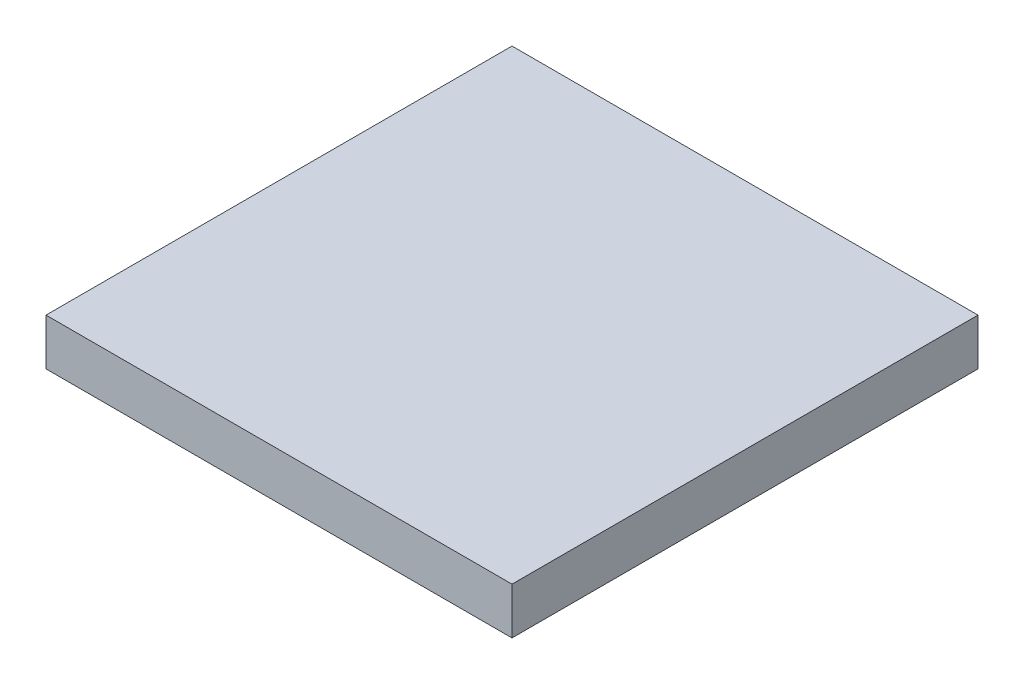
ISO-10303-21;
HEADER;
FILE_DESCRIPTION(('STEP AP214'),'2;1');
FILE_NAME('part.step','',(''),(''),'','','');
FILE_SCHEMA(('AUTOMOTIVE_DESIGN { 1 0 10303 214 1 1 1 1 }'));
ENDSEC;
DATA;
#1=APPLICATION_CONTEXT('core data for automotive mechanical design processes');
#2=APPLICATION_PROTOCOL_DEFINITION('international standard','automotive_design',2000,#1);
#3=PRODUCT_CONTEXT('',#1,'mechanical');
#4=PRODUCT('Part','Part','',(#3));
#5=PRODUCT_RELATED_PRODUCT_CATEGORY('part','',(#4));
#6=PRODUCT_DEFINITION_FORMATION('','',#4);
#7=PRODUCT_DEFINITION_CONTEXT('part definition',#1,'design');
#8=PRODUCT_DEFINITION('design','',#6,#7);
#9=PRODUCT_DEFINITION_SHAPE('','',#8);
#10=(LENGTH_UNIT() NAMED_UNIT(*) SI_UNIT(.MILLI.,.METRE.));
#11=(NAMED_UNIT(*) PLANE_ANGLE_UNIT() SI_UNIT($,.RADIAN.));
#12=(NAMED_UNIT(*) SI_UNIT($,.STERADIAN.) SOLID_ANGLE_UNIT());
#13=UNCERTAINTY_MEASURE_WITH_UNIT(LENGTH_MEASURE(1.E-05),#10,'distance_accuracy_value','');
#14=(GEOMETRIC_REPRESENTATION_CONTEXT(3) GLOBAL_UNCERTAINTY_ASSIGNED_CONTEXT((#13)) GLOBAL_UNIT_ASSIGNED_CONTEXT((#10,
#11,#12)) REPRESENTATION_CONTEXT('',''));
#15=CARTESIAN_POINT('',(0.,0.,0.));
#16=DIRECTION('',(0.,0.,1.));
#17=DIRECTION('',(1.,0.,0.));
#18=AXIS2_PLACEMENT_3D('',#15,#16,#17);
#19=CARTESIAN_POINT('',(-2.5,0.5,-2.5));
#20=DIRECTION('',(1.,0.,0.));
#21=DIRECTION('',(0.,0.,-1.));
#22=AXIS2_PLACEMENT_3D('',#19,#20,#21);
#23=PLANE('',#22);
#24=DIRECTION('',(0.,0.,1.));
#25=VECTOR('',#24,1.);
#26=CARTESIAN_POINT('',(-2.5,0.,-2.5));
#27=LINE('',#26,#25);
#28=CARTESIAN_POINT('',(-2.5,0.,-2.5));
#29=VERTEX_POINT('',#28);
#30=CARTESIAN_POINT('',(-2.5,0.,2.5));
#31=VERTEX_POINT('',#30);
#32=EDGE_CURVE('E97',#29,#31,#27,.T.);
#33=ORIENTED_EDGE('',*,*,#32,.T.);
#34=DIRECTION('',(0.,-1.,0.));
#35=VECTOR('',#34,1.);
#36=CARTESIAN_POINT('',(-2.5,0.5,2.5));
#37=LINE('',#36,#35);
#38=CARTESIAN_POINT('',(-2.5,0.5,2.5));
#39=VERTEX_POINT('',#38);
#40=EDGE_CURVE('E11',#39,#31,#37,.T.);
#41=ORIENTED_EDGE('',*,*,#40,.F.);
#42=DIRECTION('',(0.,0.,1.));
#43=VECTOR('',#42,1.);
#44=CARTESIAN_POINT('',(-2.5,0.5,-2.5));
#45=LINE('',#44,#43);
#46=CARTESIAN_POINT('',(-2.5,0.5,-2.5));
#47=VERTEX_POINT('',#46);
#48=EDGE_CURVE('E85',#47,#39,#45,.T.);
#49=ORIENTED_EDGE('',*,*,#48,.F.);
#50=DIRECTION('',(0.,-1.,0.));
#51=VECTOR('',#50,1.);
#52=CARTESIAN_POINT('',(-2.5,0.5,-2.5));
#53=LINE('',#52,#51);
#54=EDGE_CURVE('E93',#47,#29,#53,.T.);
#55=ORIENTED_EDGE('',*,*,#54,.T.);
#56=EDGE_LOOP('',(#33,#41,#49,#55));
#57=FACE_BOUND('',#56,.T.);
#58=ADVANCED_FACE('F34',(#57),#23,.F.);
#59=CARTESIAN_POINT('',(-2.5,0.5,2.5));
#60=DIRECTION('',(0.,0.,-1.));
#61=DIRECTION('',(-1.,0.,0.));
#62=AXIS2_PLACEMENT_3D('',#59,#60,#61);
#63=PLANE('',#62);
#64=DIRECTION('',(1.,0.,0.));
#65=VECTOR('',#64,1.);
#66=CARTESIAN_POINT('',(-2.5,0.,2.5));
#67=LINE('',#66,#65);
#68=CARTESIAN_POINT('',(2.5,0.,2.5));
#69=VERTEX_POINT('',#68);
#70=EDGE_CURVE('E89',#31,#69,#67,.T.);
#71=ORIENTED_EDGE('',*,*,#70,.T.);
#72=DIRECTION('',(0.,-1.,0.));
#73=VECTOR('',#72,1.);
#74=CARTESIAN_POINT('',(2.5,0.5,2.5));
#75=LINE('',#74,#73);
#76=CARTESIAN_POINT('',(2.5,0.5,2.5));
#77=VERTEX_POINT('',#76);
#78=EDGE_CURVE('E42',#77,#69,#75,.T.);
#79=ORIENTED_EDGE('',*,*,#78,.F.);
#80=DIRECTION('',(1.,0.,0.));
#81=VECTOR('',#80,1.);
#82=CARTESIAN_POINT('',(-2.5,0.5,2.5));
#83=LINE('',#82,#81);
#84=EDGE_CURVE('E80',#39,#77,#83,.T.);
#85=ORIENTED_EDGE('',*,*,#84,.F.);
#86=ORIENTED_EDGE('',*,*,#40,.T.);
#87=EDGE_LOOP('',(#71,#79,#85,#86));
#88=FACE_BOUND('',#87,.T.);
#89=ADVANCED_FACE('F88',(#88),#63,.F.);
#90=CARTESIAN_POINT('',(2.5,0.5,-2.5));
#91=DIRECTION('',(-1.,0.,0.));
#92=DIRECTION('',(0.,0.,1.));
#93=AXIS2_PLACEMENT_3D('',#90,#91,#92);
#94=PLANE('',#93);
#95=DIRECTION('',(0.,0.,-1.));
#96=VECTOR('',#95,1.);
#97=CARTESIAN_POINT('',(2.5,0.,-2.5));
#98=LINE('',#97,#96);
#99=CARTESIAN_POINT('',(2.5,0.,-2.5));
#100=VERTEX_POINT('',#99);
#101=EDGE_CURVE('E67',#69,#100,#98,.T.);
#102=ORIENTED_EDGE('',*,*,#101,.T.);
#103=DIRECTION('',(0.,-1.,0.));
#104=VECTOR('',#103,1.);
#105=CARTESIAN_POINT('',(2.5,0.5,-2.5));
#106=LINE('',#105,#104);
#107=CARTESIAN_POINT('',(2.5,0.5,-2.5));
#108=VERTEX_POINT('',#107);
#109=EDGE_CURVE('E90',#108,#100,#106,.T.);
#110=ORIENTED_EDGE('',*,*,#109,.F.);
#111=DIRECTION('',(0.,0.,-1.));
#112=VECTOR('',#111,1.);
#113=CARTESIAN_POINT('',(2.5,0.5,-2.5));
#114=LINE('',#113,#112);
#115=EDGE_CURVE('E83',#77,#108,#114,.T.);
#116=ORIENTED_EDGE('',*,*,#115,.F.);
#117=ORIENTED_EDGE('',*,*,#78,.T.);
#118=EDGE_LOOP('',(#102,#110,#116,#117));
#119=FACE_BOUND('',#118,.T.);
#120=ADVANCED_FACE('F91',(#119),#94,.F.);
#121=CARTESIAN_POINT('',(-2.5,0.5,-2.5));
#122=DIRECTION('',(0.,0.,1.));
#123=DIRECTION('',(1.,0.,0.));
#124=AXIS2_PLACEMENT_3D('',#121,#122,#123);
#125=PLANE('',#124);
#126=DIRECTION('',(-1.,0.,0.));
#127=VECTOR('',#126,1.);
#128=CARTESIAN_POINT('',(-2.5,0.,-2.5));
#129=LINE('',#128,#127);
#130=EDGE_CURVE('E73',#100,#29,#129,.T.);
#131=ORIENTED_EDGE('',*,*,#130,.T.);
#132=ORIENTED_EDGE('',*,*,#54,.F.);
#133=DIRECTION('',(-1.,0.,0.));
#134=VECTOR('',#133,1.);
#135=CARTESIAN_POINT('',(-2.5,0.5,-2.5));
#136=LINE('',#135,#134);
#137=EDGE_CURVE('E50',#108,#47,#136,.T.);
#138=ORIENTED_EDGE('',*,*,#137,.F.);
#139=ORIENTED_EDGE('',*,*,#109,.T.);
#140=EDGE_LOOP('',(#131,#132,#138,#139));
#141=FACE_BOUND('',#140,.T.);
#142=ADVANCED_FACE('F104',(#141),#125,.F.);
#143=CARTESIAN_POINT('',(0.,0.5,0.));
#144=DIRECTION('',(0.,1.,0.));
#145=DIRECTION('',(0.,0.,1.));
#146=AXIS2_PLACEMENT_3D('',#143,#144,#145);
#147=PLANE('',#146);
#148=ORIENTED_EDGE('',*,*,#48,.T.);
#149=ORIENTED_EDGE('',*,*,#84,.T.);
#150=ORIENTED_EDGE('',*,*,#115,.T.);
#151=ORIENTED_EDGE('',*,*,#137,.T.);
#152=EDGE_LOOP('',(#148,#149,#150,#151));
#153=FACE_BOUND('',#152,.T.);
#154=ADVANCED_FACE('F81',(#153),#147,.T.);
#155=CARTESIAN_POINT('',(0.,0.,0.));
#156=DIRECTION('',(0.,1.,0.));
#157=DIRECTION('',(0.,0.,1.));
#158=AXIS2_PLACEMENT_3D('',#155,#156,#157);
#159=PLANE('',#158);
#160=ORIENTED_EDGE('',*,*,#32,.F.);
#161=ORIENTED_EDGE('',*,*,#130,.F.);
#162=ORIENTED_EDGE('',*,*,#101,.F.);
#163=ORIENTED_EDGE('',*,*,#70,.F.);
#164=EDGE_LOOP('',(#160,#161,#162,#163));
#165=FACE_BOUND('',#164,.T.);
#166=ADVANCED_FACE('F107',(#165),#159,.F.);
#167=CLOSED_SHELL('',(#58,#89,#120,#142,#154,#166));
#168=MANIFOLD_SOLID_BREP('B2',#167);
#169=ADVANCED_BREP_SHAPE_REPRESENTATION('',(#18,#168),#14);
#170=SHAPE_DEFINITION_REPRESENTATION(#9,#169);
ENDSEC;
END-ISO-10303-21;
